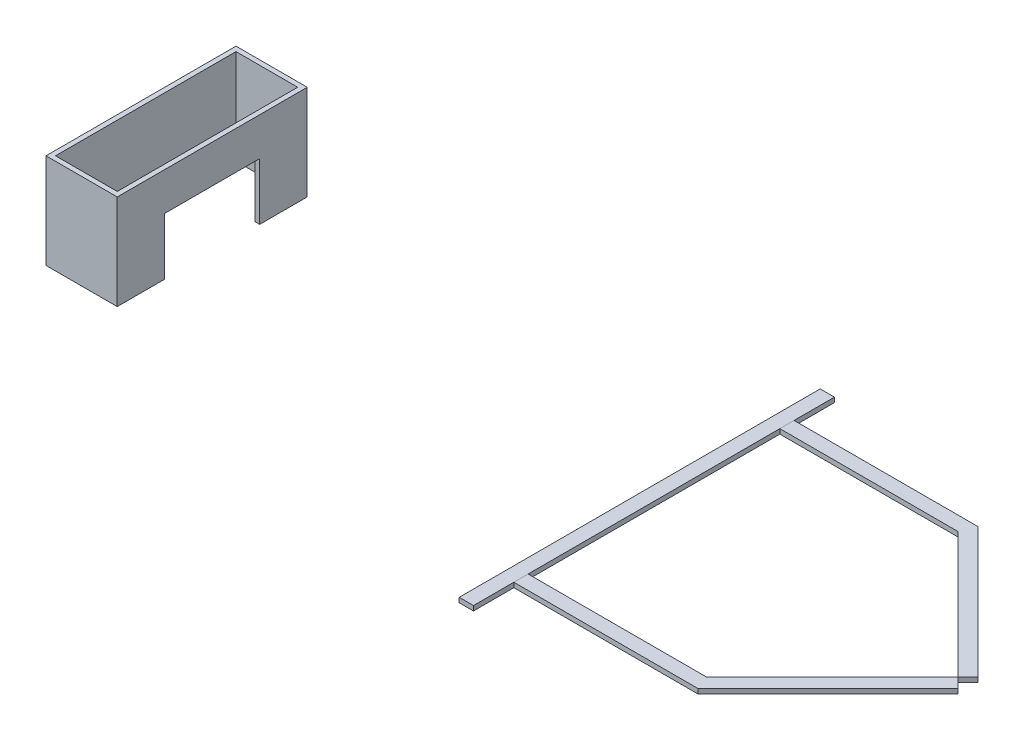
ISO-10303-21;
HEADER;
FILE_DESCRIPTION(('STEP AP214'),'2;1');
FILE_NAME('part.step','',(''),(''),'','','');
FILE_SCHEMA(('AUTOMOTIVE_DESIGN { 1 0 10303 214 1 1 1 1 }'));
ENDSEC;
DATA;
#1=APPLICATION_CONTEXT('core data for automotive mechanical design processes');
#2=APPLICATION_PROTOCOL_DEFINITION('international standard','automotive_design',2000,#1);
#3=PRODUCT_CONTEXT('',#1,'mechanical');
#4=PRODUCT('Part','Part','',(#3));
#5=PRODUCT_RELATED_PRODUCT_CATEGORY('part','',(#4));
#6=PRODUCT_DEFINITION_FORMATION('','',#4);
#7=PRODUCT_DEFINITION_CONTEXT('part definition',#1,'design');
#8=PRODUCT_DEFINITION('design','',#6,#7);
#9=PRODUCT_DEFINITION_SHAPE('','',#8);
#10=(LENGTH_UNIT() NAMED_UNIT(*) SI_UNIT(.MILLI.,.METRE.));
#11=(NAMED_UNIT(*) PLANE_ANGLE_UNIT() SI_UNIT($,.RADIAN.));
#12=(NAMED_UNIT(*) SI_UNIT($,.STERADIAN.) SOLID_ANGLE_UNIT());
#13=UNCERTAINTY_MEASURE_WITH_UNIT(LENGTH_MEASURE(1.E-05),#10,'distance_accuracy_value','');
#14=(GEOMETRIC_REPRESENTATION_CONTEXT(3) GLOBAL_UNCERTAINTY_ASSIGNED_CONTEXT((#13)) GLOBAL_UNIT_ASSIGNED_CONTEXT((#10,
#11,#12)) REPRESENTATION_CONTEXT('',''));
#15=CARTESIAN_POINT('',(0.,0.,0.));
#16=DIRECTION('',(0.,0.,1.));
#17=DIRECTION('',(1.,0.,0.));
#18=AXIS2_PLACEMENT_3D('',#15,#16,#17);
#19=CARTESIAN_POINT('',(0.,200.,0.));
#20=DIRECTION('',(0.,1.,0.));
#21=DIRECTION('',(0.,0.,1.));
#22=AXIS2_PLACEMENT_3D('',#19,#20,#21);
#23=PLANE('',#22);
#24=DIRECTION('',(-1.,0.,0.));
#25=VECTOR('',#24,1.);
#26=CARTESIAN_POINT('',(-1222.9521540317,200.,329.648768766375));
#27=LINE('',#26,#25);
#28=CARTESIAN_POINT('',(-1222.9521540317,200.,329.648768766375));
#29=VERTEX_POINT('',#28);
#30=CARTESIAN_POINT('',(-1372.9521540317,200.,329.648768766375));
#31=VERTEX_POINT('',#30);
#32=EDGE_CURVE('E184',#29,#31,#27,.T.);
#33=ORIENTED_EDGE('',*,*,#32,.F.);
#34=DIRECTION('',(0.,0.,1.));
#35=VECTOR('',#34,1.);
#36=CARTESIAN_POINT('',(-1222.9521540317,200.,-70.3512312336246));
#37=LINE('',#36,#35);
#38=CARTESIAN_POINT('',(-1222.9521540317,200.,-70.3512312336246));
#39=VERTEX_POINT('',#38);
#40=EDGE_CURVE('E192',#39,#29,#37,.T.);
#41=ORIENTED_EDGE('',*,*,#40,.F.);
#42=DIRECTION('',(-1.,0.,0.));
#43=VECTOR('',#42,1.);
#44=CARTESIAN_POINT('',(-1222.9521540317,200.,-70.3512312336246));
#45=LINE('',#44,#43);
#46=CARTESIAN_POINT('',(-1372.9521540317,200.,-70.3512312336246));
#47=VERTEX_POINT('',#46);
#48=EDGE_CURVE('E190',#39,#47,#45,.T.);
#49=ORIENTED_EDGE('',*,*,#48,.T.);
#50=DIRECTION('',(0.,0.,1.));
#51=VECTOR('',#50,1.);
#52=CARTESIAN_POINT('',(-1372.9521540317,200.,-70.3512312336246));
#53=LINE('',#52,#51);
#54=EDGE_CURVE('E187',#47,#31,#53,.T.);
#55=ORIENTED_EDGE('',*,*,#54,.T.);
#56=EDGE_LOOP('',(#33,#41,#49,#55));
#57=FACE_BOUND('',#56,.T.);
#58=DIRECTION('',(1.,0.,0.));
#59=VECTOR('',#58,1.);
#60=CARTESIAN_POINT('',(-1362.9521540317,200.,319.648768766375));
#61=LINE('',#60,#59);
#62=CARTESIAN_POINT('',(-1362.9521540317,200.,319.648768766375));
#63=VERTEX_POINT('',#62);
#64=CARTESIAN_POINT('',(-1232.9521540317,200.,319.648768766375));
#65=VERTEX_POINT('',#64);
#66=EDGE_CURVE('E245',#63,#65,#61,.T.);
#67=ORIENTED_EDGE('',*,*,#66,.F.);
#68=DIRECTION('',(0.,0.,1.));
#69=VECTOR('',#68,1.);
#70=CARTESIAN_POINT('',(-1362.9521540317,200.,-60.3512312336246));
#71=LINE('',#70,#69);
#72=CARTESIAN_POINT('',(-1362.9521540317,200.,-60.3512312336246));
#73=VERTEX_POINT('',#72);
#74=EDGE_CURVE('E168',#73,#63,#71,.T.);
#75=ORIENTED_EDGE('',*,*,#74,.F.);
#76=DIRECTION('',(-1.,0.,0.));
#77=VECTOR('',#76,1.);
#78=CARTESIAN_POINT('',(-1232.9521540317,200.,-60.3512312336246));
#79=LINE('',#78,#77);
#80=CARTESIAN_POINT('',(-1232.9521540317,200.,-60.3512312336246));
#81=VERTEX_POINT('',#80);
#82=EDGE_CURVE('E176',#81,#73,#79,.T.);
#83=ORIENTED_EDGE('',*,*,#82,.F.);
#84=DIRECTION('',(0.,0.,-1.));
#85=VECTOR('',#84,1.);
#86=CARTESIAN_POINT('',(-1232.9521540317,200.,319.648768766375));
#87=LINE('',#86,#85);
#88=EDGE_CURVE('E247',#65,#81,#87,.T.);
#89=ORIENTED_EDGE('',*,*,#88,.F.);
#90=EDGE_LOOP('',(#67,#75,#83,#89));
#91=FACE_BOUND('',#90,.T.);
#92=ADVANCED_FACE('F48',(#57,#91),#23,.T.);
#93=CARTESIAN_POINT('',(0.,0.,0.));
#94=DIRECTION('',(0.,1.,0.));
#95=DIRECTION('',(0.,0.,1.));
#96=AXIS2_PLACEMENT_3D('',#93,#94,#95);
#97=PLANE('',#96);
#98=DIRECTION('',(0.,0.,-1.));
#99=VECTOR('',#98,1.);
#100=CARTESIAN_POINT('',(-1232.9521540317,0.,319.648768766375));
#101=LINE('',#100,#99);
#102=CARTESIAN_POINT('',(-1232.9521540317,0.,319.648768766375));
#103=VERTEX_POINT('',#102);
#104=CARTESIAN_POINT('',(-1232.9521540317,0.,229.648768766375));
#105=VERTEX_POINT('',#104);
#106=EDGE_CURVE('E155',#103,#105,#101,.T.);
#107=ORIENTED_EDGE('',*,*,#106,.T.);
#108=DIRECTION('',(1.,0.,0.));
#109=VECTOR('',#108,1.);
#110=CARTESIAN_POINT('',(-1232.9521540317,0.,229.648768766375));
#111=LINE('',#110,#109);
#112=CARTESIAN_POINT('',(-1222.9521540317,0.,229.648768766375));
#113=VERTEX_POINT('',#112);
#114=EDGE_CURVE('E140',#105,#113,#111,.T.);
#115=ORIENTED_EDGE('',*,*,#114,.T.);
#116=DIRECTION('',(0.,0.,1.));
#117=VECTOR('',#116,1.);
#118=CARTESIAN_POINT('',(-1222.9521540317,0.,-70.3512312336246));
#119=LINE('',#118,#117);
#120=CARTESIAN_POINT('',(-1222.9521540317,0.,329.648768766375));
#121=VERTEX_POINT('',#120);
#122=EDGE_CURVE('E202',#113,#121,#119,.T.);
#123=ORIENTED_EDGE('',*,*,#122,.T.);
#124=DIRECTION('',(-1.,0.,0.));
#125=VECTOR('',#124,1.);
#126=CARTESIAN_POINT('',(-1222.9521540317,0.,329.648768766375));
#127=LINE('',#126,#125);
#128=CARTESIAN_POINT('',(-1372.9521540317,0.,329.648768766375));
#129=VERTEX_POINT('',#128);
#130=EDGE_CURVE('E183',#121,#129,#127,.T.);
#131=ORIENTED_EDGE('',*,*,#130,.T.);
#132=DIRECTION('',(0.,0.,1.));
#133=VECTOR('',#132,1.);
#134=CARTESIAN_POINT('',(-1372.9521540317,0.,-70.3512312336246));
#135=LINE('',#134,#133);
#136=CARTESIAN_POINT('',(-1372.9521540317,0.,-70.3512312336246));
#137=VERTEX_POINT('',#136);
#138=EDGE_CURVE('E197',#137,#129,#135,.T.);
#139=ORIENTED_EDGE('',*,*,#138,.F.);
#140=DIRECTION('',(-1.,0.,0.));
#141=VECTOR('',#140,1.);
#142=CARTESIAN_POINT('',(-1222.9521540317,0.,-70.3512312336246));
#143=LINE('',#142,#141);
#144=CARTESIAN_POINT('',(-1222.9521540317,0.,-70.3512312336246));
#145=VERTEX_POINT('',#144);
#146=EDGE_CURVE('E200',#145,#137,#143,.T.);
#147=ORIENTED_EDGE('',*,*,#146,.F.);
#148=CARTESIAN_POINT('',(-1222.9521540317,0.,29.6487687663754));
#149=VERTEX_POINT('',#148);
#150=EDGE_CURVE('E188',#145,#149,#119,.T.);
#151=ORIENTED_EDGE('',*,*,#150,.T.);
#152=DIRECTION('',(1.,0.,0.));
#153=VECTOR('',#152,1.);
#154=CARTESIAN_POINT('',(-1232.9521540317,0.,29.6487687663754));
#155=LINE('',#154,#153);
#156=CARTESIAN_POINT('',(-1232.9521540317,0.,29.6487687663754));
#157=VERTEX_POINT('',#156);
#158=EDGE_CURVE('E149',#157,#149,#155,.T.);
#159=ORIENTED_EDGE('',*,*,#158,.F.);
#160=CARTESIAN_POINT('',(-1232.9521540317,0.,-60.3512312336246));
#161=VERTEX_POINT('',#160);
#162=EDGE_CURVE('E165',#157,#161,#101,.T.);
#163=ORIENTED_EDGE('',*,*,#162,.T.);
#164=DIRECTION('',(-1.,0.,0.));
#165=VECTOR('',#164,1.);
#166=CARTESIAN_POINT('',(-1232.9521540317,0.,-60.3512312336246));
#167=LINE('',#166,#165);
#168=CARTESIAN_POINT('',(-1362.9521540317,0.,-60.3512312336246));
#169=VERTEX_POINT('',#168);
#170=EDGE_CURVE('E164',#161,#169,#167,.T.);
#171=ORIENTED_EDGE('',*,*,#170,.T.);
#172=DIRECTION('',(0.,0.,1.));
#173=VECTOR('',#172,1.);
#174=CARTESIAN_POINT('',(-1362.9521540317,0.,-60.3512312336246));
#175=LINE('',#174,#173);
#176=CARTESIAN_POINT('',(-1362.9521540317,0.,319.648768766375));
#177=VERTEX_POINT('',#176);
#178=EDGE_CURVE('E240',#169,#177,#175,.T.);
#179=ORIENTED_EDGE('',*,*,#178,.T.);
#180=DIRECTION('',(1.,0.,0.));
#181=VECTOR('',#180,1.);
#182=CARTESIAN_POINT('',(-1362.9521540317,0.,319.648768766375));
#183=LINE('',#182,#181);
#184=EDGE_CURVE('E163',#177,#103,#183,.T.);
#185=ORIENTED_EDGE('',*,*,#184,.T.);
#186=EDGE_LOOP('',(#107,#115,#123,#131,#139,#147,#151,#159,#163,#171,#179,#185));
#187=FACE_BOUND('',#186,.T.);
#188=ADVANCED_FACE('F161',(#187),#97,.F.);
#189=CARTESIAN_POINT('',(-1222.9521540317,200.,329.648768766375));
#190=DIRECTION('',(0.,0.,1.));
#191=DIRECTION('',(1.,0.,0.));
#192=AXIS2_PLACEMENT_3D('',#189,#190,#191);
#193=PLANE('',#192);
#194=ORIENTED_EDGE('',*,*,#130,.F.);
#195=DIRECTION('',(0.,-1.,0.));
#196=VECTOR('',#195,1.);
#197=CARTESIAN_POINT('',(-1222.9521540317,200.,329.648768766375));
#198=LINE('',#197,#196);
#199=EDGE_CURVE('E12',#29,#121,#198,.T.);
#200=ORIENTED_EDGE('',*,*,#199,.F.);
#201=ORIENTED_EDGE('',*,*,#32,.T.);
#202=DIRECTION('',(0.,-1.,0.));
#203=VECTOR('',#202,1.);
#204=CARTESIAN_POINT('',(-1372.9521540317,200.,329.648768766375));
#205=LINE('',#204,#203);
#206=EDGE_CURVE('E52',#31,#129,#205,.T.);
#207=ORIENTED_EDGE('',*,*,#206,.T.);
#208=EDGE_LOOP('',(#194,#200,#201,#207));
#209=FACE_BOUND('',#208,.T.);
#210=ADVANCED_FACE('F50',(#209),#193,.T.);
#211=CARTESIAN_POINT('',(-1222.9521540317,200.,-70.3512312336246));
#212=DIRECTION('',(1.,0.,0.));
#213=DIRECTION('',(0.,0.,-1.));
#214=AXIS2_PLACEMENT_3D('',#211,#212,#213);
#215=PLANE('',#214);
#216=DIRECTION('',(0.,-1.,0.));
#217=VECTOR('',#216,1.);
#218=CARTESIAN_POINT('',(-1222.9521540317,120.,229.648768766375));
#219=LINE('',#218,#217);
#220=CARTESIAN_POINT('',(-1222.9521540317,120.,229.648768766375));
#221=VERTEX_POINT('',#220);
#222=EDGE_CURVE('E145',#221,#113,#219,.T.);
#223=ORIENTED_EDGE('',*,*,#222,.F.);
#224=DIRECTION('',(0.,0.,1.));
#225=VECTOR('',#224,1.);
#226=CARTESIAN_POINT('',(-1222.9521540317,120.,229.648768766375));
#227=LINE('',#226,#225);
#228=CARTESIAN_POINT('',(-1222.9521540317,120.,29.6487687663755));
#229=VERTEX_POINT('',#228);
#230=EDGE_CURVE('E159',#229,#221,#227,.T.);
#231=ORIENTED_EDGE('',*,*,#230,.F.);
#232=DIRECTION('',(0.,1.,0.));
#233=VECTOR('',#232,1.);
#234=CARTESIAN_POINT('',(-1222.9521540317,120.,29.6487687663755));
#235=LINE('',#234,#233);
#236=EDGE_CURVE('E230',#149,#229,#235,.T.);
#237=ORIENTED_EDGE('',*,*,#236,.F.);
#238=ORIENTED_EDGE('',*,*,#150,.F.);
#239=DIRECTION('',(0.,-1.,0.));
#240=VECTOR('',#239,1.);
#241=CARTESIAN_POINT('',(-1222.9521540317,200.,-70.3512312336246));
#242=LINE('',#241,#240);
#243=EDGE_CURVE('E57',#39,#145,#242,.T.);
#244=ORIENTED_EDGE('',*,*,#243,.F.);
#245=ORIENTED_EDGE('',*,*,#40,.T.);
#246=ORIENTED_EDGE('',*,*,#199,.T.);
#247=ORIENTED_EDGE('',*,*,#122,.F.);
#248=EDGE_LOOP('',(#223,#231,#237,#238,#244,#245,#246,#247));
#249=FACE_BOUND('',#248,.T.);
#250=ADVANCED_FACE('F218',(#249),#215,.T.);
#251=CARTESIAN_POINT('',(-1222.9521540317,200.,-70.3512312336246));
#252=DIRECTION('',(0.,0.,1.));
#253=DIRECTION('',(1.,0.,0.));
#254=AXIS2_PLACEMENT_3D('',#251,#252,#253);
#255=PLANE('',#254);
#256=ORIENTED_EDGE('',*,*,#146,.T.);
#257=DIRECTION('',(0.,-1.,0.));
#258=VECTOR('',#257,1.);
#259=CARTESIAN_POINT('',(-1372.9521540317,200.,-70.3512312336246));
#260=LINE('',#259,#258);
#261=EDGE_CURVE('E205',#47,#137,#260,.T.);
#262=ORIENTED_EDGE('',*,*,#261,.F.);
#263=ORIENTED_EDGE('',*,*,#48,.F.);
#264=ORIENTED_EDGE('',*,*,#243,.T.);
#265=EDGE_LOOP('',(#256,#262,#263,#264));
#266=FACE_BOUND('',#265,.T.);
#267=ADVANCED_FACE('F224',(#266),#255,.F.);
#268=CARTESIAN_POINT('',(-1372.9521540317,200.,-70.3512312336246));
#269=DIRECTION('',(1.,0.,0.));
#270=DIRECTION('',(0.,0.,-1.));
#271=AXIS2_PLACEMENT_3D('',#268,#269,#270);
#272=PLANE('',#271);
#273=ORIENTED_EDGE('',*,*,#138,.T.);
#274=ORIENTED_EDGE('',*,*,#206,.F.);
#275=ORIENTED_EDGE('',*,*,#54,.F.);
#276=ORIENTED_EDGE('',*,*,#261,.T.);
#277=EDGE_LOOP('',(#273,#274,#275,#276));
#278=FACE_BOUND('',#277,.T.);
#279=ADVANCED_FACE('F215',(#278),#272,.F.);
#280=CARTESIAN_POINT('',(-1362.9521540317,200.,-60.3512312336246));
#281=DIRECTION('',(1.,0.,0.));
#282=DIRECTION('',(0.,0.,-1.));
#283=AXIS2_PLACEMENT_3D('',#280,#281,#282);
#284=PLANE('',#283);
#285=ORIENTED_EDGE('',*,*,#178,.F.);
#286=DIRECTION('',(0.,-1.,0.));
#287=VECTOR('',#286,1.);
#288=CARTESIAN_POINT('',(-1362.9521540317,200.,-60.3512312336246));
#289=LINE('',#288,#287);
#290=EDGE_CURVE('E173',#73,#169,#289,.T.);
#291=ORIENTED_EDGE('',*,*,#290,.F.);
#292=ORIENTED_EDGE('',*,*,#74,.T.);
#293=DIRECTION('',(0.,-1.,0.));
#294=VECTOR('',#293,1.);
#295=CARTESIAN_POINT('',(-1362.9521540317,200.,319.648768766375));
#296=LINE('',#295,#294);
#297=EDGE_CURVE('E180',#63,#177,#296,.T.);
#298=ORIENTED_EDGE('',*,*,#297,.T.);
#299=EDGE_LOOP('',(#285,#291,#292,#298));
#300=FACE_BOUND('',#299,.T.);
#301=ADVANCED_FACE('F251',(#300),#284,.T.);
#302=CARTESIAN_POINT('',(-1362.9521540317,200.,319.648768766375));
#303=DIRECTION('',(0.,0.,-1.));
#304=DIRECTION('',(-1.,0.,0.));
#305=AXIS2_PLACEMENT_3D('',#302,#303,#304);
#306=PLANE('',#305);
#307=ORIENTED_EDGE('',*,*,#184,.F.);
#308=ORIENTED_EDGE('',*,*,#297,.F.);
#309=ORIENTED_EDGE('',*,*,#66,.T.);
#310=DIRECTION('',(0.,-1.,0.));
#311=VECTOR('',#310,1.);
#312=CARTESIAN_POINT('',(-1232.9521540317,200.,319.648768766375));
#313=LINE('',#312,#311);
#314=EDGE_CURVE('E178',#65,#103,#313,.T.);
#315=ORIENTED_EDGE('',*,*,#314,.T.);
#316=EDGE_LOOP('',(#307,#308,#309,#315));
#317=FACE_BOUND('',#316,.T.);
#318=ADVANCED_FACE('F259',(#317),#306,.T.);
#319=CARTESIAN_POINT('',(-1232.9521540317,200.,319.648768766375));
#320=DIRECTION('',(-1.,0.,0.));
#321=DIRECTION('',(0.,0.,1.));
#322=AXIS2_PLACEMENT_3D('',#319,#320,#321);
#323=PLANE('',#322);
#324=DIRECTION('',(0.,-1.,0.));
#325=VECTOR('',#324,1.);
#326=CARTESIAN_POINT('',(-1232.9521540317,120.,229.648768766375));
#327=LINE('',#326,#325);
#328=CARTESIAN_POINT('',(-1232.9521540317,120.,229.648768766375));
#329=VERTEX_POINT('',#328);
#330=EDGE_CURVE('E143',#329,#105,#327,.T.);
#331=ORIENTED_EDGE('',*,*,#330,.T.);
#332=ORIENTED_EDGE('',*,*,#106,.F.);
#333=ORIENTED_EDGE('',*,*,#314,.F.);
#334=ORIENTED_EDGE('',*,*,#88,.T.);
#335=DIRECTION('',(0.,-1.,0.));
#336=VECTOR('',#335,1.);
#337=CARTESIAN_POINT('',(-1232.9521540317,200.,-60.3512312336246));
#338=LINE('',#337,#336);
#339=EDGE_CURVE('E73',#81,#161,#338,.T.);
#340=ORIENTED_EDGE('',*,*,#339,.T.);
#341=ORIENTED_EDGE('',*,*,#162,.F.);
#342=DIRECTION('',(0.,1.,0.));
#343=VECTOR('',#342,1.);
#344=CARTESIAN_POINT('',(-1232.9521540317,120.,29.6487687663755));
#345=LINE('',#344,#343);
#346=CARTESIAN_POINT('',(-1232.9521540317,120.,29.6487687663754));
#347=VERTEX_POINT('',#346);
#348=EDGE_CURVE('E158',#157,#347,#345,.T.);
#349=ORIENTED_EDGE('',*,*,#348,.T.);
#350=DIRECTION('',(0.,0.,1.));
#351=VECTOR('',#350,1.);
#352=CARTESIAN_POINT('',(-1232.9521540317,120.,229.648768766375));
#353=LINE('',#352,#351);
#354=EDGE_CURVE('E65',#347,#329,#353,.T.);
#355=ORIENTED_EDGE('',*,*,#354,.T.);
#356=EDGE_LOOP('',(#331,#332,#333,#334,#340,#341,#349,#355));
#357=FACE_BOUND('',#356,.T.);
#358=ADVANCED_FACE('F153',(#357),#323,.T.);
#359=CARTESIAN_POINT('',(-1232.9521540317,200.,-60.3512312336246));
#360=DIRECTION('',(0.,0.,1.));
#361=DIRECTION('',(1.,0.,0.));
#362=AXIS2_PLACEMENT_3D('',#359,#360,#361);
#363=PLANE('',#362);
#364=ORIENTED_EDGE('',*,*,#170,.F.);
#365=ORIENTED_EDGE('',*,*,#339,.F.);
#366=ORIENTED_EDGE('',*,*,#82,.T.);
#367=ORIENTED_EDGE('',*,*,#290,.T.);
#368=EDGE_LOOP('',(#364,#365,#366,#367));
#369=FACE_BOUND('',#368,.T.);
#370=ADVANCED_FACE('F254',(#369),#363,.T.);
#371=CARTESIAN_POINT('',(-1232.9521540317,120.,229.648768766375));
#372=DIRECTION('',(0.,0.,1.));
#373=DIRECTION('',(1.,0.,0.));
#374=AXIS2_PLACEMENT_3D('',#371,#372,#373);
#375=PLANE('',#374);
#376=ORIENTED_EDGE('',*,*,#222,.T.);
#377=ORIENTED_EDGE('',*,*,#114,.F.);
#378=ORIENTED_EDGE('',*,*,#330,.F.);
#379=DIRECTION('',(1.,0.,0.));
#380=VECTOR('',#379,1.);
#381=CARTESIAN_POINT('',(-1232.9521540317,120.,229.648768766375));
#382=LINE('',#381,#380);
#383=EDGE_CURVE('E238',#329,#221,#382,.T.);
#384=ORIENTED_EDGE('',*,*,#383,.T.);
#385=EDGE_LOOP('',(#376,#377,#378,#384));
#386=FACE_BOUND('',#385,.T.);
#387=ADVANCED_FACE('F142',(#386),#375,.F.);
#388=CARTESIAN_POINT('',(-1232.9521540317,120.,229.648768766375));
#389=DIRECTION('',(0.,1.,0.));
#390=DIRECTION('',(0.,0.,1.));
#391=AXIS2_PLACEMENT_3D('',#388,#389,#390);
#392=PLANE('',#391);
#393=ORIENTED_EDGE('',*,*,#230,.T.);
#394=ORIENTED_EDGE('',*,*,#383,.F.);
#395=ORIENTED_EDGE('',*,*,#354,.F.);
#396=DIRECTION('',(1.,0.,0.));
#397=VECTOR('',#396,1.);
#398=CARTESIAN_POINT('',(-1232.9521540317,120.,29.6487687663755));
#399=LINE('',#398,#397);
#400=EDGE_CURVE('E241',#347,#229,#399,.T.);
#401=ORIENTED_EDGE('',*,*,#400,.T.);
#402=EDGE_LOOP('',(#393,#394,#395,#401));
#403=FACE_BOUND('',#402,.T.);
#404=ADVANCED_FACE('F263',(#403),#392,.F.);
#405=CARTESIAN_POINT('',(-1232.9521540317,120.,29.6487687663755));
#406=DIRECTION('',(0.,0.,-1.));
#407=DIRECTION('',(0.,1.,0.));
#408=AXIS2_PLACEMENT_3D('',#405,#406,#407);
#409=PLANE('',#408);
#410=ORIENTED_EDGE('',*,*,#236,.T.);
#411=ORIENTED_EDGE('',*,*,#400,.F.);
#412=ORIENTED_EDGE('',*,*,#348,.F.);
#413=ORIENTED_EDGE('',*,*,#158,.T.);
#414=EDGE_LOOP('',(#410,#411,#412,#413));
#415=FACE_BOUND('',#414,.T.);
#416=ADVANCED_FACE('F261',(#415),#409,.F.);
#417=CLOSED_SHELL('',(#92,#188,#210,#250,#267,#279,#301,#318,#358,#370,#387,#404,#416));
#418=MANIFOLD_SOLID_BREP('B2',#417);
#419=CARTESIAN_POINT('',(-322.952154031702,10.,509.648768766375));
#420=DIRECTION('',(0.,0.,-1.));
#421=DIRECTION('',(-1.,0.,0.));
#422=AXIS2_PLACEMENT_3D('',#419,#420,#421);
#423=PLANE('',#422);
#424=DIRECTION('',(1.,0.,0.));
#425=VECTOR('',#424,1.);
#426=CARTESIAN_POINT('',(-322.952154031702,0.,509.648768766375));
#427=LINE('',#426,#425);
#428=CARTESIAN_POINT('',(-322.952154031702,0.,509.648768766375));
#429=VERTEX_POINT('',#428);
#430=CARTESIAN_POINT('',(-292.952154031702,0.,509.648768766375));
#431=VERTEX_POINT('',#430);
#432=EDGE_CURVE('E441',#429,#431,#427,.T.);
#433=ORIENTED_EDGE('',*,*,#432,.T.);
#434=DIRECTION('',(0.,-1.,0.));
#435=VECTOR('',#434,1.);
#436=CARTESIAN_POINT('',(-292.952154031702,10.,509.648768766375));
#437=LINE('',#436,#435);
#438=CARTESIAN_POINT('',(-292.952154031702,10.,509.648768766375));
#439=VERTEX_POINT('',#438);
#440=EDGE_CURVE('E46',#439,#431,#437,.T.);
#441=ORIENTED_EDGE('',*,*,#440,.F.);
#442=DIRECTION('',(1.,0.,0.));
#443=VECTOR('',#442,1.);
#444=CARTESIAN_POINT('',(-322.952154031702,10.,509.648768766375));
#445=LINE('',#444,#443);
#446=CARTESIAN_POINT('',(-322.952154031702,10.,509.648768766375));
#447=VERTEX_POINT('',#446);
#448=EDGE_CURVE('E418',#447,#439,#445,.T.);
#449=ORIENTED_EDGE('',*,*,#448,.F.);
#450=DIRECTION('',(0.,-1.,0.));
#451=VECTOR('',#450,1.);
#452=CARTESIAN_POINT('',(-322.952154031702,10.,509.648768766375));
#453=LINE('',#452,#451);
#454=EDGE_CURVE('E437',#447,#429,#453,.T.);
#455=ORIENTED_EDGE('',*,*,#454,.T.);
#456=EDGE_LOOP('',(#433,#441,#449,#455));
#457=FACE_BOUND('',#456,.T.);
#458=ADVANCED_FACE('F379',(#457),#423,.F.);
#459=CARTESIAN_POINT('',(-292.952154031702,10.,-250.351231233625));
#460=DIRECTION('',(1.,0.,0.));
#461=DIRECTION('',(0.,0.,-1.));
#462=AXIS2_PLACEMENT_3D('',#459,#460,#461);
#463=PLANE('',#462);
#464=DIRECTION('',(0.,0.,1.));
#465=VECTOR('',#464,1.);
#466=CARTESIAN_POINT('',(-292.952154031702,0.,-250.351231233625));
#467=LINE('',#466,#465);
#468=CARTESIAN_POINT('',(-292.952154031702,0.,-250.351231233625));
#469=VERTEX_POINT('',#468);
#470=EDGE_CURVE('E427',#469,#431,#467,.T.);
#471=ORIENTED_EDGE('',*,*,#470,.F.);
#472=DIRECTION('',(0.,-1.,0.));
#473=VECTOR('',#472,1.);
#474=CARTESIAN_POINT('',(-292.952154031702,10.,-250.351231233625));
#475=LINE('',#474,#473);
#476=CARTESIAN_POINT('',(-292.952154031702,10.,-250.351231233625));
#477=VERTEX_POINT('',#476);
#478=EDGE_CURVE('E387',#477,#469,#475,.T.);
#479=ORIENTED_EDGE('',*,*,#478,.F.);
#480=DIRECTION('',(0.,0.,1.));
#481=VECTOR('',#480,1.);
#482=CARTESIAN_POINT('',(-292.952154031702,10.,-250.351231233625));
#483=LINE('',#482,#481);
#484=EDGE_CURVE('E425',#477,#439,#483,.T.);
#485=ORIENTED_EDGE('',*,*,#484,.T.);
#486=ORIENTED_EDGE('',*,*,#440,.T.);
#487=EDGE_LOOP('',(#471,#479,#485,#486));
#488=FACE_BOUND('',#487,.T.);
#489=ADVANCED_FACE('F424',(#488),#463,.T.);
#490=CARTESIAN_POINT('',(-322.952154031702,10.,-250.351231233625));
#491=DIRECTION('',(0.,0.,-1.));
#492=DIRECTION('',(-1.,0.,0.));
#493=AXIS2_PLACEMENT_3D('',#490,#491,#492);
#494=PLANE('',#493);
#495=DIRECTION('',(1.,0.,0.));
#496=VECTOR('',#495,1.);
#497=CARTESIAN_POINT('',(-322.952154031702,0.,-250.351231233625));
#498=LINE('',#497,#496);
#499=CARTESIAN_POINT('',(-322.952154031702,0.,-250.351231233625));
#500=VERTEX_POINT('',#499);
#501=EDGE_CURVE('E445',#500,#469,#498,.T.);
#502=ORIENTED_EDGE('',*,*,#501,.F.);
#503=DIRECTION('',(0.,-1.,0.));
#504=VECTOR('',#503,1.);
#505=CARTESIAN_POINT('',(-322.952154031702,10.,-250.351231233625));
#506=LINE('',#505,#504);
#507=CARTESIAN_POINT('',(-322.952154031702,10.,-250.351231233625));
#508=VERTEX_POINT('',#507);
#509=EDGE_CURVE('E410',#508,#500,#506,.T.);
#510=ORIENTED_EDGE('',*,*,#509,.F.);
#511=DIRECTION('',(1.,0.,0.));
#512=VECTOR('',#511,1.);
#513=CARTESIAN_POINT('',(-322.952154031702,10.,-250.351231233625));
#514=LINE('',#513,#512);
#515=EDGE_CURVE('E433',#508,#477,#514,.T.);
#516=ORIENTED_EDGE('',*,*,#515,.T.);
#517=ORIENTED_EDGE('',*,*,#478,.T.);
#518=EDGE_LOOP('',(#502,#510,#516,#517));
#519=FACE_BOUND('',#518,.T.);
#520=ADVANCED_FACE('F435',(#519),#494,.T.);
#521=CARTESIAN_POINT('',(-322.952154031702,10.,-250.351231233625));
#522=DIRECTION('',(1.,0.,0.));
#523=DIRECTION('',(0.,0.,-1.));
#524=AXIS2_PLACEMENT_3D('',#521,#522,#523);
#525=PLANE('',#524);
#526=DIRECTION('',(0.,0.,1.));
#527=VECTOR('',#526,1.);
#528=CARTESIAN_POINT('',(-322.952154031702,0.,-250.351231233625));
#529=LINE('',#528,#527);
#530=EDGE_CURVE('E413',#500,#429,#529,.T.);
#531=ORIENTED_EDGE('',*,*,#530,.T.);
#532=ORIENTED_EDGE('',*,*,#454,.F.);
#533=DIRECTION('',(0.,0.,1.));
#534=VECTOR('',#533,1.);
#535=CARTESIAN_POINT('',(-322.952154031702,10.,-250.351231233625));
#536=LINE('',#535,#534);
#537=EDGE_CURVE('E395',#508,#447,#536,.T.);
#538=ORIENTED_EDGE('',*,*,#537,.F.);
#539=ORIENTED_EDGE('',*,*,#509,.T.);
#540=EDGE_LOOP('',(#531,#532,#538,#539));
#541=FACE_BOUND('',#540,.T.);
#542=ADVANCED_FACE('F458',(#541),#525,.F.);
#543=CARTESIAN_POINT('',(0.,10.,0.));
#544=DIRECTION('',(0.,-1.,0.));
#545=DIRECTION('',(0.,0.,-1.));
#546=AXIS2_PLACEMENT_3D('',#543,#544,#545);
#547=PLANE('',#546);
#548=ORIENTED_EDGE('',*,*,#448,.T.);
#549=ORIENTED_EDGE('',*,*,#484,.F.);
#550=ORIENTED_EDGE('',*,*,#515,.F.);
#551=ORIENTED_EDGE('',*,*,#537,.T.);
#552=EDGE_LOOP('',(#548,#549,#550,#551));
#553=FACE_BOUND('',#552,.T.);
#554=ADVANCED_FACE('F432',(#553),#547,.F.);
#555=CARTESIAN_POINT('',(0.,0.,0.));
#556=DIRECTION('',(0.,-1.,0.));
#557=DIRECTION('',(0.,0.,-1.));
#558=AXIS2_PLACEMENT_3D('',#555,#556,#557);
#559=PLANE('',#558);
#560=ORIENTED_EDGE('',*,*,#432,.F.);
#561=ORIENTED_EDGE('',*,*,#530,.F.);
#562=ORIENTED_EDGE('',*,*,#501,.T.);
#563=ORIENTED_EDGE('',*,*,#470,.T.);
#564=EDGE_LOOP('',(#560,#561,#562,#563));
#565=FACE_BOUND('',#564,.T.);
#566=ADVANCED_FACE('F452',(#565),#559,.T.);
#567=CLOSED_SHELL('',(#458,#489,#520,#542,#554,#566));
#568=MANIFOLD_SOLID_BREP('B6',#567);
#569=CARTESIAN_POINT('',(0.,10.,394.648768766375));
#570=DIRECTION('',(0.,0.,-1.));
#571=DIRECTION('',(-1.,0.,0.));
#572=AXIS2_PLACEMENT_3D('',#569,#570,#571);
#573=PLANE('',#572);
#574=DIRECTION('',(1.,0.,0.));
#575=VECTOR('',#574,1.);
#576=CARTESIAN_POINT('',(0.,0.,394.648768766375));
#577=LINE('',#576,#575);
#578=CARTESIAN_POINT('',(-292.942154031702,0.,394.648768766375));
#579=VERTEX_POINT('',#578);
#580=CARTESIAN_POINT('',(81.8244399682975,0.,394.648768766375));
#581=VERTEX_POINT('',#580);
#582=EDGE_CURVE('E377',#579,#581,#577,.T.);
#583=ORIENTED_EDGE('',*,*,#582,.F.);
#584=DIRECTION('',(0.,-1.,0.));
#585=VECTOR('',#584,1.);
#586=CARTESIAN_POINT('',(-292.942154031702,10.,394.648768766375));
#587=LINE('',#586,#585);
#588=CARTESIAN_POINT('',(-292.942154031702,10.,394.648768766375));
#589=VERTEX_POINT('',#588);
#590=EDGE_CURVE('E531',#589,#579,#587,.T.);
#591=ORIENTED_EDGE('',*,*,#590,.F.);
#592=DIRECTION('',(1.,0.,0.));
#593=VECTOR('',#592,1.);
#594=CARTESIAN_POINT('',(0.,10.,394.648768766375));
#595=LINE('',#594,#593);
#596=CARTESIAN_POINT('',(81.8244399682975,10.,394.648768766375));
#597=VERTEX_POINT('',#596);
#598=EDGE_CURVE('E605',#589,#597,#595,.T.);
#599=ORIENTED_EDGE('',*,*,#598,.T.);
#600=DIRECTION('',(0.,-1.,0.));
#601=VECTOR('',#600,1.);
#602=CARTESIAN_POINT('',(81.8244399682975,10.,394.648768766375));
#603=LINE('',#602,#601);
#604=EDGE_CURVE('E558',#597,#581,#603,.T.);
#605=ORIENTED_EDGE('',*,*,#604,.T.);
#606=EDGE_LOOP('',(#583,#591,#599,#605));
#607=FACE_BOUND('',#606,.T.);
#608=ADVANCED_FACE('F512',(#607),#573,.T.);
#609=CARTESIAN_POINT('',(-292.942154031702,10.,0.));
#610=DIRECTION('',(-1.,0.,0.));
#611=DIRECTION('',(0.,0.,1.));
#612=AXIS2_PLACEMENT_3D('',#609,#610,#611);
#613=PLANE('',#612);
#614=DIRECTION('',(0.,0.,-1.));
#615=VECTOR('',#614,1.);
#616=CARTESIAN_POINT('',(-292.942154031702,0.,0.));
#617=LINE('',#616,#615);
#618=CARTESIAN_POINT('',(-292.942154031702,0.,424.648768766375));
#619=VERTEX_POINT('',#618);
#620=EDGE_CURVE('E522',#619,#579,#617,.T.);
#621=ORIENTED_EDGE('',*,*,#620,.F.);
#622=DIRECTION('',(0.,-1.,0.));
#623=VECTOR('',#622,1.);
#624=CARTESIAN_POINT('',(-292.942154031702,10.,424.648768766375));
#625=LINE('',#624,#623);
#626=CARTESIAN_POINT('',(-292.942154031702,10.,424.648768766375));
#627=VERTEX_POINT('',#626);
#628=EDGE_CURVE('E549',#627,#619,#625,.T.);
#629=ORIENTED_EDGE('',*,*,#628,.F.);
#630=DIRECTION('',(0.,0.,-1.));
#631=VECTOR('',#630,1.);
#632=CARTESIAN_POINT('',(-292.942154031702,10.,0.));
#633=LINE('',#632,#631);
#634=EDGE_CURVE('E604',#627,#589,#633,.T.);
#635=ORIENTED_EDGE('',*,*,#634,.T.);
#636=ORIENTED_EDGE('',*,*,#590,.T.);
#637=EDGE_LOOP('',(#621,#629,#635,#636));
#638=FACE_BOUND('',#637,.T.);
#639=ADVANCED_FACE('F622',(#638),#613,.T.);
#640=CARTESIAN_POINT('',(0.,10.,424.648768766375));
#641=DIRECTION('',(0.,0.,-1.));
#642=DIRECTION('',(-1.,0.,0.));
#643=AXIS2_PLACEMENT_3D('',#640,#641,#642);
#644=PLANE('',#643);
#645=DIRECTION('',(1.,0.,0.));
#646=VECTOR('',#645,1.);
#647=CARTESIAN_POINT('',(0.,0.,424.648768766375));
#648=LINE('',#647,#646);
#649=CARTESIAN_POINT('',(94.2508468394901,0.,424.648768766375));
#650=VERTEX_POINT('',#649);
#651=EDGE_CURVE('E567',#619,#650,#648,.T.);
#652=ORIENTED_EDGE('',*,*,#651,.T.);
#653=DIRECTION('',(0.,-1.,0.));
#654=VECTOR('',#653,1.);
#655=CARTESIAN_POINT('',(94.2508468394901,10.,424.648768766375));
#656=LINE('',#655,#654);
#657=CARTESIAN_POINT('',(94.2508468394901,10.,424.648768766375));
#658=VERTEX_POINT('',#657);
#659=EDGE_CURVE('E570',#658,#650,#656,.T.);
#660=ORIENTED_EDGE('',*,*,#659,.F.);
#661=DIRECTION('',(1.,0.,0.));
#662=VECTOR('',#661,1.);
#663=CARTESIAN_POINT('',(0.,10.,424.648768766375));
#664=LINE('',#663,#662);
#665=EDGE_CURVE('E602',#627,#658,#664,.T.);
#666=ORIENTED_EDGE('',*,*,#665,.F.);
#667=ORIENTED_EDGE('',*,*,#628,.T.);
#668=EDGE_LOOP('',(#652,#660,#666,#667));
#669=FACE_BOUND('',#668,.T.);
#670=ADVANCED_FACE('F569',(#669),#644,.F.);
#671=CARTESIAN_POINT('',(259.449807802932,10.,259.449807802937));
#672=DIRECTION('',(-0.70710678118654,0.,-0.707106781186555));
#673=DIRECTION('',(-0.707106781186555,0.,0.70710678118654));
#674=AXIS2_PLACEMENT_3D('',#671,#672,#673);
#675=PLANE('',#674);
#676=DIRECTION('',(0.707106781186555,0.,-0.70710678118654));
#677=VECTOR('',#676,1.);
#678=CARTESIAN_POINT('',(259.449807802932,0.,259.449807802937));
#679=LINE('',#678,#677);
#680=CARTESIAN_POINT('',(368.0376434039,0.,150.861972201972));
#681=VERTEX_POINT('',#680);
#682=EDGE_CURVE('E575',#650,#681,#679,.T.);
#683=ORIENTED_EDGE('',*,*,#682,.T.);
#684=DIRECTION('',(0.,-1.,0.));
#685=VECTOR('',#684,1.);
#686=CARTESIAN_POINT('',(368.0376434039,10.,150.861972201972));
#687=LINE('',#686,#685);
#688=CARTESIAN_POINT('',(368.0376434039,10.,150.861972201972));
#689=VERTEX_POINT('',#688);
#690=EDGE_CURVE('E582',#689,#681,#687,.T.);
#691=ORIENTED_EDGE('',*,*,#690,.F.);
#692=DIRECTION('',(0.707106781186555,0.,-0.70710678118654));
#693=VECTOR('',#692,1.);
#694=CARTESIAN_POINT('',(259.449807802932,10.,259.449807802937));
#695=LINE('',#694,#693);
#696=EDGE_CURVE('E581',#658,#689,#695,.T.);
#697=ORIENTED_EDGE('',*,*,#696,.F.);
#698=ORIENTED_EDGE('',*,*,#659,.T.);
#699=EDGE_LOOP('',(#683,#691,#697,#698));
#700=FACE_BOUND('',#699,.T.);
#701=ADVANCED_FACE('F578',(#700),#675,.F.);
#702=CARTESIAN_POINT('',(108.587835600967,10.,-108.587835600965));
#703=DIRECTION('',(-0.707106781186554,0.,0.707106781186541));
#704=DIRECTION('',(0.707106781186541,0.,0.707106781186554));
#705=AXIS2_PLACEMENT_3D('',#702,#703,#704);
#706=PLANE('',#705);
#707=DIRECTION('',(-0.707106781186541,0.,-0.707106781186554));
#708=VECTOR('',#707,1.);
#709=CARTESIAN_POINT('',(108.587835600967,0.,-108.587835600965));
#710=LINE('',#709,#708);
#711=CARTESIAN_POINT('',(346.824439968304,0.,129.648768766375));
#712=VERTEX_POINT('',#711);
#713=EDGE_CURVE('E588',#681,#712,#710,.T.);
#714=ORIENTED_EDGE('',*,*,#713,.T.);
#715=DIRECTION('',(0.,-1.,0.));
#716=VECTOR('',#715,1.);
#717=CARTESIAN_POINT('',(346.824439968304,10.,129.648768766375));
#718=LINE('',#717,#716);
#719=CARTESIAN_POINT('',(346.824439968304,10.,129.648768766375));
#720=VERTEX_POINT('',#719);
#721=EDGE_CURVE('E516',#720,#712,#718,.T.);
#722=ORIENTED_EDGE('',*,*,#721,.F.);
#723=DIRECTION('',(-0.707106781186541,0.,-0.707106781186554));
#724=VECTOR('',#723,1.);
#725=CARTESIAN_POINT('',(108.587835600967,10.,-108.587835600965));
#726=LINE('',#725,#724);
#727=EDGE_CURVE('E598',#689,#720,#726,.T.);
#728=ORIENTED_EDGE('',*,*,#727,.F.);
#729=ORIENTED_EDGE('',*,*,#690,.T.);
#730=EDGE_LOOP('',(#714,#722,#728,#729));
#731=FACE_BOUND('',#730,.T.);
#732=ADVANCED_FACE('F619',(#731),#706,.F.);
#733=CARTESIAN_POINT('',(238.236604367335,10.,238.236604367341));
#734=DIRECTION('',(-0.707106781186539,0.,-0.707106781186556));
#735=DIRECTION('',(-0.707106781186556,0.,0.707106781186539));
#736=AXIS2_PLACEMENT_3D('',#733,#734,#735);
#737=PLANE('',#736);
#738=DIRECTION('',(0.707106781186556,0.,-0.707106781186539));
#739=VECTOR('',#738,1.);
#740=CARTESIAN_POINT('',(238.236604367335,0.,238.236604367341));
#741=LINE('',#740,#739);
#742=EDGE_CURVE('E590',#581,#712,#741,.T.);
#743=ORIENTED_EDGE('',*,*,#742,.F.);
#744=ORIENTED_EDGE('',*,*,#604,.F.);
#745=DIRECTION('',(0.707106781186556,0.,-0.707106781186539));
#746=VECTOR('',#745,1.);
#747=CARTESIAN_POINT('',(238.236604367335,10.,238.236604367341));
#748=LINE('',#747,#746);
#749=EDGE_CURVE('E595',#597,#720,#748,.T.);
#750=ORIENTED_EDGE('',*,*,#749,.T.);
#751=ORIENTED_EDGE('',*,*,#721,.T.);
#752=EDGE_LOOP('',(#743,#744,#750,#751));
#753=FACE_BOUND('',#752,.T.);
#754=ADVANCED_FACE('F616',(#753),#737,.T.);
#755=CARTESIAN_POINT('',(0.,10.,0.));
#756=DIRECTION('',(0.,1.,0.));
#757=DIRECTION('',(0.,0.,1.));
#758=AXIS2_PLACEMENT_3D('',#755,#756,#757);
#759=PLANE('',#758);
#760=ORIENTED_EDGE('',*,*,#598,.F.);
#761=ORIENTED_EDGE('',*,*,#634,.F.);
#762=ORIENTED_EDGE('',*,*,#665,.T.);
#763=ORIENTED_EDGE('',*,*,#696,.T.);
#764=ORIENTED_EDGE('',*,*,#727,.T.);
#765=ORIENTED_EDGE('',*,*,#749,.F.);
#766=EDGE_LOOP('',(#760,#761,#762,#763,#764,#765));
#767=FACE_BOUND('',#766,.T.);
#768=ADVANCED_FACE('F514',(#767),#759,.T.);
#769=CARTESIAN_POINT('',(0.,0.,0.));
#770=DIRECTION('',(0.,1.,0.));
#771=DIRECTION('',(0.,0.,1.));
#772=AXIS2_PLACEMENT_3D('',#769,#770,#771);
#773=PLANE('',#772);
#774=ORIENTED_EDGE('',*,*,#582,.T.);
#775=ORIENTED_EDGE('',*,*,#742,.T.);
#776=ORIENTED_EDGE('',*,*,#713,.F.);
#777=ORIENTED_EDGE('',*,*,#682,.F.);
#778=ORIENTED_EDGE('',*,*,#651,.F.);
#779=ORIENTED_EDGE('',*,*,#620,.T.);
#780=EDGE_LOOP('',(#774,#775,#776,#777,#778,#779));
#781=FACE_BOUND('',#780,.T.);
#782=ADVANCED_FACE('F585',(#781),#773,.F.);
#783=CLOSED_SHELL('',(#608,#639,#670,#701,#732,#754,#768,#782));
#784=MANIFOLD_SOLID_BREP('B40',#783);
#785=CARTESIAN_POINT('',(94.2508468394904,10.,-165.351231233625));
#786=DIRECTION('',(0.707106781186539,0.,-0.707106781186556));
#787=DIRECTION('',(-0.707106781186556,0.,-0.707106781186539));
#788=AXIS2_PLACEMENT_3D('',#785,#786,#787);
#789=PLANE('',#788);
#790=DIRECTION('',(0.707106781186556,0.,0.707106781186539));
#791=VECTOR('',#790,1.);
#792=CARTESIAN_POINT('',(94.2508468394904,0.,-165.351231233625));
#793=LINE('',#792,#791);
#794=CARTESIAN_POINT('',(94.2508468394904,0.,-165.351231233625));
#795=VERTEX_POINT('',#794);
#796=CARTESIAN_POINT('',(368.0376434039,0.,108.435565330779));
#797=VERTEX_POINT('',#796);
#798=EDGE_CURVE('E751',#795,#797,#793,.T.);
#799=ORIENTED_EDGE('',*,*,#798,.F.);
#800=DIRECTION('',(0.,-1.,0.));
#801=VECTOR('',#800,1.);
#802=CARTESIAN_POINT('',(94.2508468394904,10.,-165.351231233625));
#803=LINE('',#802,#801);
#804=CARTESIAN_POINT('',(94.2508468394904,10.,-165.351231233625));
#805=VERTEX_POINT('',#804);
#806=EDGE_CURVE('E696',#805,#795,#803,.T.);
#807=ORIENTED_EDGE('',*,*,#806,.F.);
#808=DIRECTION('',(0.707106781186556,0.,0.707106781186539));
#809=VECTOR('',#808,1.);
#810=CARTESIAN_POINT('',(94.2508468394904,10.,-165.351231233625));
#811=LINE('',#810,#809);
#812=CARTESIAN_POINT('',(368.0376434039,10.,108.435565330779));
#813=VERTEX_POINT('',#812);
#814=EDGE_CURVE('E760',#805,#813,#811,.T.);
#815=ORIENTED_EDGE('',*,*,#814,.T.);
#816=DIRECTION('',(0.,-1.,0.));
#817=VECTOR('',#816,1.);
#818=CARTESIAN_POINT('',(368.0376434039,10.,108.435565330779));
#819=LINE('',#818,#817);
#820=EDGE_CURVE('E690',#813,#797,#819,.T.);
#821=ORIENTED_EDGE('',*,*,#820,.T.);
#822=EDGE_LOOP('',(#799,#807,#815,#821));
#823=FACE_BOUND('',#822,.T.);
#824=ADVANCED_FACE('F687',(#823),#789,.T.);
#825=CARTESIAN_POINT('',(-292.942154031702,10.,-165.351231233625));
#826=DIRECTION('',(0.,0.,-1.));
#827=DIRECTION('',(-1.,0.,0.));
#828=AXIS2_PLACEMENT_3D('',#825,#826,#827);
#829=PLANE('',#828);
#830=DIRECTION('',(1.,0.,0.));
#831=VECTOR('',#830,1.);
#832=CARTESIAN_POINT('',(-292.942154031702,0.,-165.351231233625));
#833=LINE('',#832,#831);
#834=CARTESIAN_POINT('',(-292.942154031702,0.,-165.351231233625));
#835=VERTEX_POINT('',#834);
#836=EDGE_CURVE('E743',#835,#795,#833,.T.);
#837=ORIENTED_EDGE('',*,*,#836,.F.);
#838=DIRECTION('',(0.,-1.,0.));
#839=VECTOR('',#838,1.);
#840=CARTESIAN_POINT('',(-292.942154031702,10.,-165.351231233625));
#841=LINE('',#840,#839);
#842=CARTESIAN_POINT('',(-292.942154031702,10.,-165.351231233625));
#843=VERTEX_POINT('',#842);
#844=EDGE_CURVE('E734',#843,#835,#841,.T.);
#845=ORIENTED_EDGE('',*,*,#844,.F.);
#846=DIRECTION('',(1.,0.,0.));
#847=VECTOR('',#846,1.);
#848=CARTESIAN_POINT('',(-292.942154031702,10.,-165.351231233625));
#849=LINE('',#848,#847);
#850=EDGE_CURVE('E745',#843,#805,#849,.T.);
#851=ORIENTED_EDGE('',*,*,#850,.T.);
#852=ORIENTED_EDGE('',*,*,#806,.T.);
#853=EDGE_LOOP('',(#837,#845,#851,#852));
#854=FACE_BOUND('',#853,.T.);
#855=ADVANCED_FACE('F741',(#854),#829,.T.);
#856=CARTESIAN_POINT('',(-292.942154031702,10.,-165.351231233625));
#857=DIRECTION('',(1.,0.,0.));
#858=DIRECTION('',(0.,0.,-1.));
#859=AXIS2_PLACEMENT_3D('',#856,#857,#858);
#860=PLANE('',#859);
#861=DIRECTION('',(0.,0.,1.));
#862=VECTOR('',#861,1.);
#863=CARTESIAN_POINT('',(-292.942154031702,0.,-165.351231233625));
#864=LINE('',#863,#862);
#865=CARTESIAN_POINT('',(-292.942154031702,0.,-135.351231233625));
#866=VERTEX_POINT('',#865);
#867=EDGE_CURVE('E759',#835,#866,#864,.T.);
#868=ORIENTED_EDGE('',*,*,#867,.T.);
#869=DIRECTION('',(0.,-1.,0.));
#870=VECTOR('',#869,1.);
#871=CARTESIAN_POINT('',(-292.942154031702,10.,-135.351231233625));
#872=LINE('',#871,#870);
#873=CARTESIAN_POINT('',(-292.942154031702,10.,-135.351231233625));
#874=VERTEX_POINT('',#873);
#875=EDGE_CURVE('E769',#874,#866,#872,.T.);
#876=ORIENTED_EDGE('',*,*,#875,.F.);
#877=DIRECTION('',(0.,0.,1.));
#878=VECTOR('',#877,1.);
#879=CARTESIAN_POINT('',(-292.942154031702,10.,-165.351231233625));
#880=LINE('',#879,#878);
#881=EDGE_CURVE('E775',#843,#874,#880,.T.);
#882=ORIENTED_EDGE('',*,*,#881,.F.);
#883=ORIENTED_EDGE('',*,*,#844,.T.);
#884=EDGE_LOOP('',(#868,#876,#882,#883));
#885=FACE_BOUND('',#884,.T.);
#886=ADVANCED_FACE('F797',(#885),#860,.F.);
#887=CARTESIAN_POINT('',(-292.942154031702,10.,-135.351231233625));
#888=DIRECTION('',(0.,0.,-1.));
#889=DIRECTION('',(-1.,0.,0.));
#890=AXIS2_PLACEMENT_3D('',#887,#888,#889);
#891=PLANE('',#890);
#892=DIRECTION('',(1.,0.,0.));
#893=VECTOR('',#892,1.);
#894=CARTESIAN_POINT('',(-292.942154031702,0.,-135.351231233625));
#895=LINE('',#894,#893);
#896=CARTESIAN_POINT('',(81.8244399682977,0.,-135.351231233625));
#897=VERTEX_POINT('',#896);
#898=EDGE_CURVE('E764',#866,#897,#895,.T.);
#899=ORIENTED_EDGE('',*,*,#898,.T.);
#900=DIRECTION('',(0.,-1.,0.));
#901=VECTOR('',#900,1.);
#902=CARTESIAN_POINT('',(81.8244399682977,10.,-135.351231233625));
#903=LINE('',#902,#901);
#904=CARTESIAN_POINT('',(81.8244399682977,10.,-135.351231233625));
#905=VERTEX_POINT('',#904);
#906=EDGE_CURVE('E771',#905,#897,#903,.T.);
#907=ORIENTED_EDGE('',*,*,#906,.F.);
#908=DIRECTION('',(1.,0.,0.));
#909=VECTOR('',#908,1.);
#910=CARTESIAN_POINT('',(-292.942154031702,10.,-135.351231233625));
#911=LINE('',#910,#909);
#912=EDGE_CURVE('E777',#874,#905,#911,.T.);
#913=ORIENTED_EDGE('',*,*,#912,.F.);
#914=ORIENTED_EDGE('',*,*,#875,.T.);
#915=EDGE_LOOP('',(#899,#907,#913,#914));
#916=FACE_BOUND('',#915,.T.);
#917=ADVANCED_FACE('F784',(#916),#891,.F.);
#918=CARTESIAN_POINT('',(81.8244399682977,10.,-135.351231233625));
#919=DIRECTION('',(0.70710678118654,0.,-0.707106781186555));
#920=DIRECTION('',(-0.707106781186555,0.,-0.70710678118654));
#921=AXIS2_PLACEMENT_3D('',#918,#919,#920);
#922=PLANE('',#921);
#923=DIRECTION('',(0.707106781186555,0.,0.70710678118654));
#924=VECTOR('',#923,1.);
#925=CARTESIAN_POINT('',(81.8244399682977,0.,-135.351231233625));
#926=LINE('',#925,#924);
#927=CARTESIAN_POINT('',(346.824439968304,0.,129.648768766375));
#928=VERTEX_POINT('',#927);
#929=EDGE_CURVE('E782',#897,#928,#926,.T.);
#930=ORIENTED_EDGE('',*,*,#929,.T.);
#931=DIRECTION('',(0.,-1.,0.));
#932=VECTOR('',#931,1.);
#933=CARTESIAN_POINT('',(346.824439968304,10.,129.648768766375));
#934=LINE('',#933,#932);
#935=CARTESIAN_POINT('',(346.824439968304,10.,129.648768766375));
#936=VERTEX_POINT('',#935);
#937=EDGE_CURVE('E510',#936,#928,#934,.T.);
#938=ORIENTED_EDGE('',*,*,#937,.F.);
#939=DIRECTION('',(0.707106781186555,0.,0.70710678118654));
#940=VECTOR('',#939,1.);
#941=CARTESIAN_POINT('',(81.8244399682977,10.,-135.351231233625));
#942=LINE('',#941,#940);
#943=EDGE_CURVE('E813',#905,#936,#942,.T.);
#944=ORIENTED_EDGE('',*,*,#943,.F.);
#945=ORIENTED_EDGE('',*,*,#906,.T.);
#946=EDGE_LOOP('',(#930,#938,#944,#945));
#947=FACE_BOUND('',#946,.T.);
#948=ADVANCED_FACE('F787',(#947),#922,.F.);
#949=CARTESIAN_POINT('',(368.0376434039,10.,108.435565330779));
#950=DIRECTION('',(0.70710678118655,0.,0.707106781186545));
#951=DIRECTION('',(0.707106781186545,0.,-0.70710678118655));
#952=AXIS2_PLACEMENT_3D('',#949,#950,#951);
#953=PLANE('',#952);
#954=DIRECTION('',(-0.707106781186545,0.,0.70710678118655));
#955=VECTOR('',#954,1.);
#956=CARTESIAN_POINT('',(368.0376434039,0.,108.435565330779));
#957=LINE('',#956,#955);
#958=EDGE_CURVE('E755',#797,#928,#957,.T.);
#959=ORIENTED_EDGE('',*,*,#958,.F.);
#960=ORIENTED_EDGE('',*,*,#820,.F.);
#961=DIRECTION('',(-0.707106781186545,0.,0.70710678118655));
#962=VECTOR('',#961,1.);
#963=CARTESIAN_POINT('',(368.0376434039,10.,108.435565330779));
#964=LINE('',#963,#962);
#965=EDGE_CURVE('E762',#813,#936,#964,.T.);
#966=ORIENTED_EDGE('',*,*,#965,.T.);
#967=ORIENTED_EDGE('',*,*,#937,.T.);
#968=EDGE_LOOP('',(#959,#960,#966,#967));
#969=FACE_BOUND('',#968,.T.);
#970=ADVANCED_FACE('F789',(#969),#953,.T.);
#971=CARTESIAN_POINT('',(0.,10.,0.));
#972=DIRECTION('',(0.,-1.,0.));
#973=DIRECTION('',(0.,0.,-1.));
#974=AXIS2_PLACEMENT_3D('',#971,#972,#973);
#975=PLANE('',#974);
#976=ORIENTED_EDGE('',*,*,#814,.F.);
#977=ORIENTED_EDGE('',*,*,#850,.F.);
#978=ORIENTED_EDGE('',*,*,#881,.T.);
#979=ORIENTED_EDGE('',*,*,#912,.T.);
#980=ORIENTED_EDGE('',*,*,#943,.T.);
#981=ORIENTED_EDGE('',*,*,#965,.F.);
#982=EDGE_LOOP('',(#976,#977,#978,#979,#980,#981));
#983=FACE_BOUND('',#982,.T.);
#984=ADVANCED_FACE('F795',(#983),#975,.F.);
#985=CARTESIAN_POINT('',(0.,0.,0.));
#986=DIRECTION('',(0.,-1.,0.));
#987=DIRECTION('',(0.,0.,-1.));
#988=AXIS2_PLACEMENT_3D('',#985,#986,#987);
#989=PLANE('',#988);
#990=ORIENTED_EDGE('',*,*,#798,.T.);
#991=ORIENTED_EDGE('',*,*,#958,.T.);
#992=ORIENTED_EDGE('',*,*,#929,.F.);
#993=ORIENTED_EDGE('',*,*,#898,.F.);
#994=ORIENTED_EDGE('',*,*,#867,.F.);
#995=ORIENTED_EDGE('',*,*,#836,.T.);
#996=EDGE_LOOP('',(#990,#991,#992,#993,#994,#995));
#997=FACE_BOUND('',#996,.T.);
#998=ADVANCED_FACE('F757',(#997),#989,.T.);
#999=CLOSED_SHELL('',(#824,#855,#886,#917,#948,#970,#984,#998));
#1000=MANIFOLD_SOLID_BREP('B371',#999);
#1001=ADVANCED_BREP_SHAPE_REPRESENTATION('',(#18,#418,#568,#784,#1000),#14);
#1002=SHAPE_DEFINITION_REPRESENTATION(#9,#1001);
ENDSEC;
END-ISO-10303-21;
